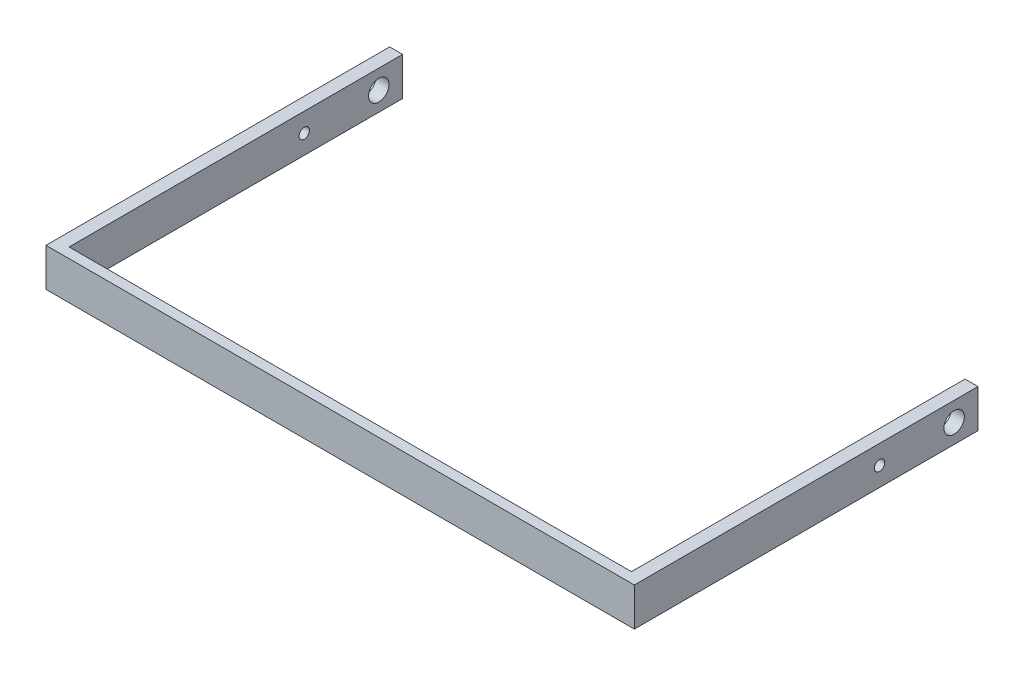
ISO-10303-21;
HEADER;
FILE_DESCRIPTION(('STEP AP214'),'2;1');
FILE_NAME('part.step','',(''),(''),'','','');
FILE_SCHEMA(('AUTOMOTIVE_DESIGN { 1 0 10303 214 1 1 1 1 }'));
ENDSEC;
DATA;
#1=APPLICATION_CONTEXT('core data for automotive mechanical design processes');
#2=APPLICATION_PROTOCOL_DEFINITION('international standard','automotive_design',2000,#1);
#3=PRODUCT_CONTEXT('',#1,'mechanical');
#4=PRODUCT('Part','Part','',(#3));
#5=PRODUCT_RELATED_PRODUCT_CATEGORY('part','',(#4));
#6=PRODUCT_DEFINITION_FORMATION('','',#4);
#7=PRODUCT_DEFINITION_CONTEXT('part definition',#1,'design');
#8=PRODUCT_DEFINITION('design','',#6,#7);
#9=PRODUCT_DEFINITION_SHAPE('','',#8);
#10=(LENGTH_UNIT() NAMED_UNIT(*) SI_UNIT(.MILLI.,.METRE.));
#11=(NAMED_UNIT(*) PLANE_ANGLE_UNIT() SI_UNIT($,.RADIAN.));
#12=(NAMED_UNIT(*) SI_UNIT($,.STERADIAN.) SOLID_ANGLE_UNIT());
#13=UNCERTAINTY_MEASURE_WITH_UNIT(LENGTH_MEASURE(1.E-05),#10,'distance_accuracy_value','');
#14=(GEOMETRIC_REPRESENTATION_CONTEXT(3) GLOBAL_UNCERTAINTY_ASSIGNED_CONTEXT((#13)) GLOBAL_UNIT_ASSIGNED_CONTEXT((#10,
#11,#12)) REPRESENTATION_CONTEXT('',''));
#15=CARTESIAN_POINT('',(0.,0.,0.));
#16=DIRECTION('',(0.,0.,1.));
#17=DIRECTION('',(1.,0.,0.));
#18=AXIS2_PLACEMENT_3D('',#15,#16,#17);
#19=CARTESIAN_POINT('',(0.,0.,308.831279690786));
#20=DIRECTION('',(0.,0.,-1.));
#21=DIRECTION('',(-1.,0.,0.));
#22=AXIS2_PLACEMENT_3D('',#19,#20,#21);
#23=PLANE('',#22);
#24=DIRECTION('',(-1.,0.,0.));
#25=VECTOR('',#24,1.);
#26=CARTESIAN_POINT('',(-6.858,-32.3124600891967,308.831279690786));
#27=LINE('',#26,#25);
#28=CARTESIAN_POINT('',(296.955331161676,-32.3124600891967,308.831279690787));
#29=VERTEX_POINT('',#28);
#30=CARTESIAN_POINT('',(0.,-32.3124600891967,308.831279690786));
#31=VERTEX_POINT('',#30);
#32=EDGE_CURVE('E86',#29,#31,#27,.T.);
#33=ORIENTED_EDGE('',*,*,#32,.F.);
#34=DIRECTION('',(0.,1.,0.));
#35=VECTOR('',#34,1.);
#36=CARTESIAN_POINT('',(296.955331161676,-32.3124600891967,308.831279690787));
#37=LINE('',#36,#35);
#38=CARTESIAN_POINT('',(296.955331161676,-52.5119186995741,308.831279690786));
#39=VERTEX_POINT('',#38);
#40=EDGE_CURVE('E166',#39,#29,#37,.T.);
#41=ORIENTED_EDGE('',*,*,#40,.F.);
#42=DIRECTION('',(1.,0.,0.));
#43=VECTOR('',#42,1.);
#44=CARTESIAN_POINT('',(-6.858,-52.5119186995742,308.831279690786));
#45=LINE('',#44,#43);
#46=CARTESIAN_POINT('',(0.,-52.5119186995742,308.831279690786));
#47=VERTEX_POINT('',#46);
#48=EDGE_CURVE('E114',#47,#39,#45,.T.);
#49=ORIENTED_EDGE('',*,*,#48,.F.);
#50=DIRECTION('',(0.,1.,0.));
#51=VECTOR('',#50,1.);
#52=CARTESIAN_POINT('',(0.,-32.3124600891967,308.831279690786));
#53=LINE('',#52,#51);
#54=EDGE_CURVE('E92',#47,#31,#53,.T.);
#55=ORIENTED_EDGE('',*,*,#54,.T.);
#56=EDGE_LOOP('',(#33,#41,#49,#55));
#57=FACE_BOUND('',#56,.T.);
#58=ADVANCED_FACE('F39',(#57),#23,.T.);
#59=CARTESIAN_POINT('',(-6.858,0.,0.));
#60=DIRECTION('',(-1.,0.,0.));
#61=DIRECTION('',(0.,0.,1.));
#62=AXIS2_PLACEMENT_3D('',#59,#60,#61);
#63=PLANE('',#62);
#64=CARTESIAN_POINT('',(-6.858,-42.4121893943855,145.296375125406));
#65=DIRECTION('',(-1.,0.,0.));
#66=DIRECTION('',(0.,0.,1.));
#67=AXIS2_PLACEMENT_3D('',#64,#65,#66);
#68=CIRCLE('',#67,5.3975);
#69=CARTESIAN_POINT('',(-6.858,-42.4121893943855,150.693875125406));
#70=VERTEX_POINT('',#69);
#71=EDGE_CURVE('E101',#70,#70,#68,.T.);
#72=ORIENTED_EDGE('',*,*,#71,.F.);
#73=EDGE_LOOP('',(#72));
#74=FACE_BOUND('',#73,.T.);
#75=DIRECTION('',(0.,-1.,0.));
#76=VECTOR('',#75,1.);
#77=CARTESIAN_POINT('',(-6.858,-32.3124600891967,132.687655189742));
#78=LINE('',#77,#76);
#79=CARTESIAN_POINT('',(-6.858,-32.3124600891967,132.687655189742));
#80=VERTEX_POINT('',#79);
#81=CARTESIAN_POINT('',(-6.858,-52.5119186995742,132.687655189742));
#82=VERTEX_POINT('',#81);
#83=EDGE_CURVE('E91',#80,#82,#78,.T.);
#84=ORIENTED_EDGE('',*,*,#83,.T.);
#85=DIRECTION('',(0.,0.,1.));
#86=VECTOR('',#85,1.);
#87=CARTESIAN_POINT('',(-6.858,-52.5119186995742,132.687655189742));
#88=LINE('',#87,#86);
#89=CARTESIAN_POINT('',(-6.858,-52.5119186995742,314.165279690786));
#90=VERTEX_POINT('',#89);
#91=EDGE_CURVE('E196',#82,#90,#88,.T.);
#92=ORIENTED_EDGE('',*,*,#91,.T.);
#93=DIRECTION('',(0.,-1.,0.));
#94=VECTOR('',#93,1.);
#95=CARTESIAN_POINT('',(-6.858,-52.5119186995742,314.165279690786));
#96=LINE('',#95,#94);
#97=CARTESIAN_POINT('',(-6.858,-32.3124600891967,314.165279690786));
#98=VERTEX_POINT('',#97);
#99=EDGE_CURVE('E177',#98,#90,#96,.T.);
#100=ORIENTED_EDGE('',*,*,#99,.F.);
#101=DIRECTION('',(0.,0.,-1.));
#102=VECTOR('',#101,1.);
#103=CARTESIAN_POINT('',(-6.858,-32.3124600891967,132.687655189742));
#104=LINE('',#103,#102);
#105=EDGE_CURVE('E63',#98,#80,#104,.T.);
#106=ORIENTED_EDGE('',*,*,#105,.T.);
#107=EDGE_LOOP('',(#84,#92,#100,#106));
#108=FACE_BOUND('',#107,.T.);
#109=CARTESIAN_POINT('',(-6.858,-42.4121893943855,184.665923862401));
#110=DIRECTION('',(-1.,0.,0.));
#111=DIRECTION('',(0.,0.,1.));
#112=AXIS2_PLACEMENT_3D('',#109,#110,#111);
#113=CIRCLE('',#112,2.73924182004585);
#114=CARTESIAN_POINT('',(-6.858,-42.4121893943855,187.405165682447));
#115=VERTEX_POINT('',#114);
#116=EDGE_CURVE('E189',#115,#115,#113,.T.);
#117=ORIENTED_EDGE('',*,*,#116,.F.);
#118=EDGE_LOOP('',(#117));
#119=FACE_BOUND('',#118,.T.);
#120=ADVANCED_FACE('F198',(#74,#108,#119),#63,.T.);
#121=CARTESIAN_POINT('',(0.,0.,0.));
#122=DIRECTION('',(-1.,0.,0.));
#123=DIRECTION('',(0.,0.,1.));
#124=AXIS2_PLACEMENT_3D('',#121,#122,#123);
#125=PLANE('',#124);
#126=DIRECTION('',(0.,-1.,0.));
#127=VECTOR('',#126,1.);
#128=CARTESIAN_POINT('',(0.,-32.3124600891967,132.687655189742));
#129=LINE('',#128,#127);
#130=CARTESIAN_POINT('',(0.,-32.3124600891967,132.687655189742));
#131=VERTEX_POINT('',#130);
#132=CARTESIAN_POINT('',(0.,-52.5119186995742,132.687655189742));
#133=VERTEX_POINT('',#132);
#134=EDGE_CURVE('E97',#131,#133,#129,.T.);
#135=ORIENTED_EDGE('',*,*,#134,.F.);
#136=DIRECTION('',(0.,0.,-1.));
#137=VECTOR('',#136,1.);
#138=CARTESIAN_POINT('',(0.,-32.3124600891967,132.687655189742));
#139=LINE('',#138,#137);
#140=EDGE_CURVE('E80',#31,#131,#139,.T.);
#141=ORIENTED_EDGE('',*,*,#140,.F.);
#142=ORIENTED_EDGE('',*,*,#54,.F.);
#143=DIRECTION('',(0.,0.,1.));
#144=VECTOR('',#143,1.);
#145=CARTESIAN_POINT('',(0.,-52.5119186995742,132.687655189742));
#146=LINE('',#145,#144);
#147=EDGE_CURVE('E100',#133,#47,#146,.T.);
#148=ORIENTED_EDGE('',*,*,#147,.F.);
#149=EDGE_LOOP('',(#135,#141,#142,#148));
#150=FACE_BOUND('',#149,.T.);
#151=CARTESIAN_POINT('',(0.,-42.4121893943855,145.296375125406));
#152=DIRECTION('',(-1.,0.,0.));
#153=DIRECTION('',(0.,0.,1.));
#154=AXIS2_PLACEMENT_3D('',#151,#152,#153);
#155=CIRCLE('',#154,5.3975);
#156=CARTESIAN_POINT('',(0.,-42.4121893943855,150.693875125406));
#157=VERTEX_POINT('',#156);
#158=EDGE_CURVE('E105',#157,#157,#155,.T.);
#159=ORIENTED_EDGE('',*,*,#158,.T.);
#160=EDGE_LOOP('',(#159));
#161=FACE_BOUND('',#160,.T.);
#162=CARTESIAN_POINT('',(0.,-42.4121893943855,184.665923862401));
#163=DIRECTION('',(-1.,0.,0.));
#164=DIRECTION('',(0.,0.,1.));
#165=AXIS2_PLACEMENT_3D('',#162,#163,#164);
#166=CIRCLE('',#165,2.73924182004585);
#167=CARTESIAN_POINT('',(0.,-42.4121893943855,187.405165682447));
#168=VERTEX_POINT('',#167);
#169=EDGE_CURVE('E188',#168,#168,#166,.T.);
#170=ORIENTED_EDGE('',*,*,#169,.T.);
#171=EDGE_LOOP('',(#170));
#172=FACE_BOUND('',#171,.T.);
#173=ADVANCED_FACE('F98',(#150,#161,#172),#125,.F.);
#174=CARTESIAN_POINT('',(-6.858,-32.3124600891967,132.687655189742));
#175=DIRECTION('',(0.,0.,1.));
#176=DIRECTION('',(1.,0.,0.));
#177=AXIS2_PLACEMENT_3D('',#174,#175,#176);
#178=PLANE('',#177);
#179=ORIENTED_EDGE('',*,*,#134,.T.);
#180=DIRECTION('',(1.,0.,0.));
#181=VECTOR('',#180,1.);
#182=CARTESIAN_POINT('',(-6.858,-52.5119186995742,132.687655189742));
#183=LINE('',#182,#181);
#184=EDGE_CURVE('E11',#82,#133,#183,.T.);
#185=ORIENTED_EDGE('',*,*,#184,.F.);
#186=ORIENTED_EDGE('',*,*,#83,.F.);
#187=DIRECTION('',(1.,0.,0.));
#188=VECTOR('',#187,1.);
#189=CARTESIAN_POINT('',(-6.858,-32.3124600891967,132.687655189742));
#190=LINE('',#189,#188);
#191=EDGE_CURVE('E47',#80,#131,#190,.T.);
#192=ORIENTED_EDGE('',*,*,#191,.T.);
#193=EDGE_LOOP('',(#179,#185,#186,#192));
#194=FACE_BOUND('',#193,.T.);
#195=ADVANCED_FACE('F41',(#194),#178,.F.);
#196=CARTESIAN_POINT('',(-6.858,-52.5119186995742,132.687655189742));
#197=DIRECTION('',(0.,1.,0.));
#198=DIRECTION('',(0.,0.,1.));
#199=AXIS2_PLACEMENT_3D('',#196,#197,#198);
#200=PLANE('',#199);
#201=ORIENTED_EDGE('',*,*,#147,.T.);
#202=ORIENTED_EDGE('',*,*,#48,.T.);
#203=DIRECTION('',(0.,0.,1.));
#204=VECTOR('',#203,1.);
#205=CARTESIAN_POINT('',(296.955331161676,-52.5119186995742,132.687655189742));
#206=LINE('',#205,#204);
#207=CARTESIAN_POINT('',(296.955331161676,-52.5119186995742,132.687655189742));
#208=VERTEX_POINT('',#207);
#209=EDGE_CURVE('E54',#208,#39,#206,.T.);
#210=ORIENTED_EDGE('',*,*,#209,.F.);
#211=DIRECTION('',(-1.,0.,0.));
#212=VECTOR('',#211,1.);
#213=CARTESIAN_POINT('',(303.813331161676,-52.5119186995742,132.687655189742));
#214=LINE('',#213,#212);
#215=CARTESIAN_POINT('',(303.813331161676,-52.5119186995742,132.687655189742));
#216=VERTEX_POINT('',#215);
#217=EDGE_CURVE('E158',#216,#208,#214,.T.);
#218=ORIENTED_EDGE('',*,*,#217,.F.);
#219=DIRECTION('',(0.,0.,-1.));
#220=VECTOR('',#219,1.);
#221=CARTESIAN_POINT('',(303.813331161677,-52.5119186995741,314.165279690786));
#222=LINE('',#221,#220);
#223=CARTESIAN_POINT('',(303.813331161677,-52.5119186995741,314.165279690786));
#224=VERTEX_POINT('',#223);
#225=EDGE_CURVE('E150',#224,#216,#222,.T.);
#226=ORIENTED_EDGE('',*,*,#225,.F.);
#227=DIRECTION('',(1.,0.,0.));
#228=VECTOR('',#227,1.);
#229=CARTESIAN_POINT('',(-6.858,-52.5119186995742,314.165279690786));
#230=LINE('',#229,#228);
#231=EDGE_CURVE('E180',#90,#224,#230,.T.);
#232=ORIENTED_EDGE('',*,*,#231,.F.);
#233=ORIENTED_EDGE('',*,*,#91,.F.);
#234=ORIENTED_EDGE('',*,*,#184,.T.);
#235=EDGE_LOOP('',(#201,#202,#210,#218,#226,#232,#233,#234));
#236=FACE_BOUND('',#235,.T.);
#237=ADVANCED_FACE('F201',(#236),#200,.F.);
#238=CARTESIAN_POINT('',(-6.858,-32.3124600891967,132.687655189742));
#239=DIRECTION('',(0.,-1.,0.));
#240=DIRECTION('',(0.,0.,-1.));
#241=AXIS2_PLACEMENT_3D('',#238,#239,#240);
#242=PLANE('',#241);
#243=ORIENTED_EDGE('',*,*,#140,.T.);
#244=ORIENTED_EDGE('',*,*,#191,.F.);
#245=ORIENTED_EDGE('',*,*,#105,.F.);
#246=DIRECTION('',(-1.,0.,0.));
#247=VECTOR('',#246,1.);
#248=CARTESIAN_POINT('',(-6.858,-32.3124600891967,314.165279690786));
#249=LINE('',#248,#247);
#250=CARTESIAN_POINT('',(303.813331161677,-32.3124600891967,314.165279690786));
#251=VERTEX_POINT('',#250);
#252=EDGE_CURVE('E146',#251,#98,#249,.T.);
#253=ORIENTED_EDGE('',*,*,#252,.F.);
#254=DIRECTION('',(0.,0.,-1.));
#255=VECTOR('',#254,1.);
#256=CARTESIAN_POINT('',(303.813331161677,-32.3124600891967,314.165279690786));
#257=LINE('',#256,#255);
#258=CARTESIAN_POINT('',(303.813331161676,-32.3124600891967,132.687655189742));
#259=VERTEX_POINT('',#258);
#260=EDGE_CURVE('E141',#251,#259,#257,.T.);
#261=ORIENTED_EDGE('',*,*,#260,.T.);
#262=DIRECTION('',(-1.,0.,0.));
#263=VECTOR('',#262,1.);
#264=CARTESIAN_POINT('',(303.813331161676,-32.3124600891967,132.687655189742));
#265=LINE('',#264,#263);
#266=CARTESIAN_POINT('',(296.955331161676,-32.3124600891967,132.687655189742));
#267=VERTEX_POINT('',#266);
#268=EDGE_CURVE('E143',#259,#267,#265,.T.);
#269=ORIENTED_EDGE('',*,*,#268,.T.);
#270=DIRECTION('',(0.,0.,-1.));
#271=VECTOR('',#270,1.);
#272=CARTESIAN_POINT('',(296.955331161676,-32.3124600891967,132.687655189742));
#273=LINE('',#272,#271);
#274=EDGE_CURVE('E173',#29,#267,#273,.T.);
#275=ORIENTED_EDGE('',*,*,#274,.F.);
#276=ORIENTED_EDGE('',*,*,#32,.T.);
#277=EDGE_LOOP('',(#243,#244,#245,#253,#261,#269,#275,#276));
#278=FACE_BOUND('',#277,.T.);
#279=ADVANCED_FACE('F82',(#278),#242,.F.);
#280=CARTESIAN_POINT('',(-6.858,-42.4121893943855,145.296375125406));
#281=DIRECTION('',(1.,0.,0.));
#282=DIRECTION('',(0.,0.,-1.));
#283=AXIS2_PLACEMENT_3D('',#280,#281,#282);
#284=CYLINDRICAL_SURFACE('',#283,5.3975);
#285=ORIENTED_EDGE('',*,*,#71,.T.);
#286=EDGE_LOOP('',(#285));
#287=FACE_BOUND('',#286,.T.);
#288=ORIENTED_EDGE('',*,*,#158,.F.);
#289=EDGE_LOOP('',(#288));
#290=FACE_BOUND('',#289,.T.);
#291=ADVANCED_FACE('F226',(#287,#290),#284,.F.);
#292=CARTESIAN_POINT('',(-6.858,-42.4121893943855,184.665923862401));
#293=DIRECTION('',(1.,0.,0.));
#294=DIRECTION('',(0.,0.,-1.));
#295=AXIS2_PLACEMENT_3D('',#292,#293,#294);
#296=CYLINDRICAL_SURFACE('',#295,2.73924182004585);
#297=ORIENTED_EDGE('',*,*,#116,.T.);
#298=EDGE_LOOP('',(#297));
#299=FACE_BOUND('',#298,.T.);
#300=ORIENTED_EDGE('',*,*,#169,.F.);
#301=EDGE_LOOP('',(#300));
#302=FACE_BOUND('',#301,.T.);
#303=ADVANCED_FACE('F214',(#299,#302),#296,.F.);
#304=CARTESIAN_POINT('',(303.813331161677,-52.5119186995741,314.165279690786));
#305=DIRECTION('',(-1.,0.,0.));
#306=DIRECTION('',(0.,0.,1.));
#307=AXIS2_PLACEMENT_3D('',#304,#305,#306);
#308=PLANE('',#307);
#309=ORIENTED_EDGE('',*,*,#225,.T.);
#310=DIRECTION('',(0.,-1.,0.));
#311=VECTOR('',#310,1.);
#312=CARTESIAN_POINT('',(303.813331161676,-32.3124600891967,132.687655189742));
#313=LINE('',#312,#311);
#314=EDGE_CURVE('E155',#259,#216,#313,.T.);
#315=ORIENTED_EDGE('',*,*,#314,.F.);
#316=ORIENTED_EDGE('',*,*,#260,.F.);
#317=DIRECTION('',(0.,1.,0.));
#318=VECTOR('',#317,1.);
#319=CARTESIAN_POINT('',(303.813331161677,-52.5119186995741,314.165279690786));
#320=LINE('',#319,#318);
#321=EDGE_CURVE('E182',#224,#251,#320,.T.);
#322=ORIENTED_EDGE('',*,*,#321,.F.);
#323=EDGE_LOOP('',(#309,#315,#316,#322));
#324=FACE_BOUND('',#323,.T.);
#325=CARTESIAN_POINT('',(303.813331161676,-42.4121893943855,184.665923862401));
#326=DIRECTION('',(-1.,0.,0.));
#327=DIRECTION('',(0.,0.,1.));
#328=AXIS2_PLACEMENT_3D('',#325,#326,#327);
#329=CIRCLE('',#328,2.73924182004585);
#330=CARTESIAN_POINT('',(303.813331161676,-42.4121893943855,187.405165682447));
#331=VERTEX_POINT('',#330);
#332=EDGE_CURVE('E346',#331,#331,#329,.T.);
#333=ORIENTED_EDGE('',*,*,#332,.T.);
#334=EDGE_LOOP('',(#333));
#335=FACE_BOUND('',#334,.T.);
#336=CARTESIAN_POINT('',(303.813331161676,-42.4121893943855,145.296375125406));
#337=DIRECTION('',(-1.,0.,0.));
#338=DIRECTION('',(0.,0.,1.));
#339=AXIS2_PLACEMENT_3D('',#336,#337,#338);
#340=CIRCLE('',#339,5.3975);
#341=CARTESIAN_POINT('',(303.813331161676,-42.4121893943855,150.693875125406));
#342=VERTEX_POINT('',#341);
#343=EDGE_CURVE('E174',#342,#342,#340,.T.);
#344=ORIENTED_EDGE('',*,*,#343,.T.);
#345=EDGE_LOOP('',(#344));
#346=FACE_BOUND('',#345,.T.);
#347=ADVANCED_FACE('F160',(#324,#335,#346),#308,.F.);
#348=CARTESIAN_POINT('',(0.,0.,314.165279690786));
#349=DIRECTION('',(0.,0.,-1.));
#350=DIRECTION('',(-1.,0.,0.));
#351=AXIS2_PLACEMENT_3D('',#348,#349,#350);
#352=PLANE('',#351);
#353=ORIENTED_EDGE('',*,*,#99,.T.);
#354=ORIENTED_EDGE('',*,*,#231,.T.);
#355=ORIENTED_EDGE('',*,*,#321,.T.);
#356=ORIENTED_EDGE('',*,*,#252,.T.);
#357=EDGE_LOOP('',(#353,#354,#355,#356));
#358=FACE_BOUND('',#357,.T.);
#359=ADVANCED_FACE('F203',(#358),#352,.F.);
#360=CARTESIAN_POINT('',(303.813331161676,-32.3124600891967,132.687655189742));
#361=DIRECTION('',(0.,0.,-1.));
#362=DIRECTION('',(-1.,0.,0.));
#363=AXIS2_PLACEMENT_3D('',#360,#361,#362);
#364=PLANE('',#363);
#365=DIRECTION('',(0.,-1.,0.));
#366=VECTOR('',#365,1.);
#367=CARTESIAN_POINT('',(296.955331161676,-32.3124600891967,132.687655189742));
#368=LINE('',#367,#366);
#369=EDGE_CURVE('E156',#267,#208,#368,.T.);
#370=ORIENTED_EDGE('',*,*,#369,.F.);
#371=ORIENTED_EDGE('',*,*,#268,.F.);
#372=ORIENTED_EDGE('',*,*,#314,.T.);
#373=ORIENTED_EDGE('',*,*,#217,.T.);
#374=EDGE_LOOP('',(#370,#371,#372,#373));
#375=FACE_BOUND('',#374,.T.);
#376=ADVANCED_FACE('F154',(#375),#364,.T.);
#377=CARTESIAN_POINT('',(296.955331161677,0.,3.86303250305686E-13));
#378=DIRECTION('',(1.,0.,0.));
#379=DIRECTION('',(0.,0.,1.));
#380=AXIS2_PLACEMENT_3D('',#377,#378,#379);
#381=PLANE('',#380);
#382=CARTESIAN_POINT('',(296.955331161676,-42.4121893943855,184.665923862401));
#383=DIRECTION('',(-1.,0.,0.));
#384=DIRECTION('',(0.,0.,1.));
#385=AXIS2_PLACEMENT_3D('',#382,#383,#384);
#386=CIRCLE('',#385,2.73924182004585);
#387=CARTESIAN_POINT('',(296.955331161676,-42.4121893943855,187.405165682447));
#388=VERTEX_POINT('',#387);
#389=EDGE_CURVE('E349',#388,#388,#386,.T.);
#390=ORIENTED_EDGE('',*,*,#389,.F.);
#391=EDGE_LOOP('',(#390));
#392=FACE_BOUND('',#391,.T.);
#393=CARTESIAN_POINT('',(296.955331161676,-42.4121893943855,145.296375125406));
#394=DIRECTION('',(-1.,0.,0.));
#395=DIRECTION('',(0.,0.,1.));
#396=AXIS2_PLACEMENT_3D('',#393,#394,#395);
#397=CIRCLE('',#396,5.3975);
#398=CARTESIAN_POINT('',(296.955331161676,-42.4121893943855,150.693875125406));
#399=VERTEX_POINT('',#398);
#400=EDGE_CURVE('E170',#399,#399,#397,.T.);
#401=ORIENTED_EDGE('',*,*,#400,.F.);
#402=EDGE_LOOP('',(#401));
#403=FACE_BOUND('',#402,.T.);
#404=ORIENTED_EDGE('',*,*,#369,.T.);
#405=ORIENTED_EDGE('',*,*,#209,.T.);
#406=ORIENTED_EDGE('',*,*,#40,.T.);
#407=ORIENTED_EDGE('',*,*,#274,.T.);
#408=EDGE_LOOP('',(#404,#405,#406,#407));
#409=FACE_BOUND('',#408,.T.);
#410=ADVANCED_FACE('F211',(#392,#403,#409),#381,.F.);
#411=CARTESIAN_POINT('',(303.813331161676,-42.4121893943855,145.296375125406));
#412=DIRECTION('',(-1.,0.,0.));
#413=DIRECTION('',(0.,0.,1.));
#414=AXIS2_PLACEMENT_3D('',#411,#412,#413);
#415=CYLINDRICAL_SURFACE('',#414,5.3975);
#416=ORIENTED_EDGE('',*,*,#343,.F.);
#417=EDGE_LOOP('',(#416));
#418=FACE_BOUND('',#417,.T.);
#419=ORIENTED_EDGE('',*,*,#400,.T.);
#420=EDGE_LOOP('',(#419));
#421=FACE_BOUND('',#420,.T.);
#422=ADVANCED_FACE('F305',(#418,#421),#415,.F.);
#423=CARTESIAN_POINT('',(303.813331161676,-42.4121893943855,184.665923862401));
#424=DIRECTION('',(-1.,0.,0.));
#425=DIRECTION('',(0.,0.,1.));
#426=AXIS2_PLACEMENT_3D('',#423,#424,#425);
#427=CYLINDRICAL_SURFACE('',#426,2.73924182004585);
#428=ORIENTED_EDGE('',*,*,#332,.F.);
#429=EDGE_LOOP('',(#428));
#430=FACE_BOUND('',#429,.T.);
#431=ORIENTED_EDGE('',*,*,#389,.T.);
#432=EDGE_LOOP('',(#431));
#433=FACE_BOUND('',#432,.T.);
#434=ADVANCED_FACE('F314',(#430,#433),#427,.F.);
#435=CLOSED_SHELL('',(#58,#120,#173,#195,#237,#279,#291,#303,#347,#359,#376,#410,#422,#434));
#436=MANIFOLD_SOLID_BREP('B2',#435);
#437=ADVANCED_BREP_SHAPE_REPRESENTATION('',(#18,#436),#14);
#438=SHAPE_DEFINITION_REPRESENTATION(#9,#437);
ENDSEC;
END-ISO-10303-21;
